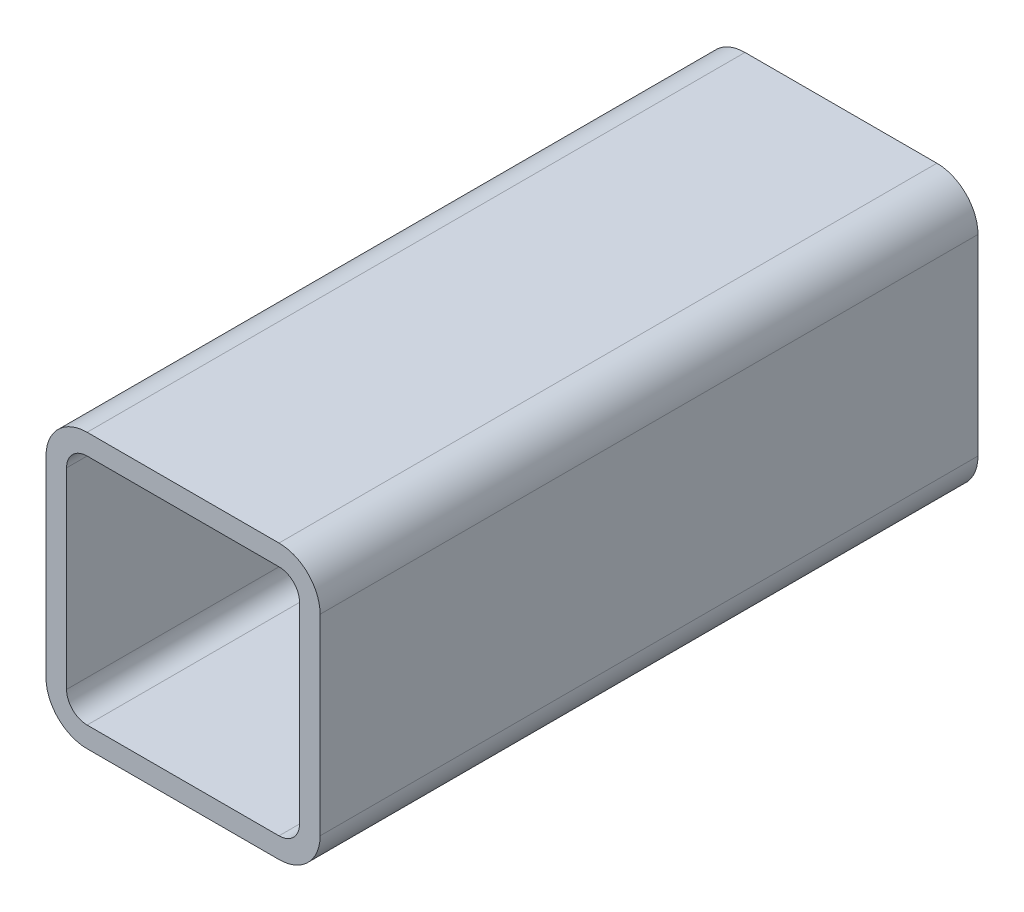
ISO-10303-21;
HEADER;
FILE_DESCRIPTION(('STEP AP214'),'2;1');
FILE_NAME('part.step','',(''),(''),'','','');
FILE_SCHEMA(('AUTOMOTIVE_DESIGN { 1 0 10303 214 1 1 1 1 }'));
ENDSEC;
DATA;
#1=APPLICATION_CONTEXT('core data for automotive mechanical design processes');
#2=APPLICATION_PROTOCOL_DEFINITION('international standard','automotive_design',2000,#1);
#3=PRODUCT_CONTEXT('',#1,'mechanical');
#4=PRODUCT('Part','Part','',(#3));
#5=PRODUCT_RELATED_PRODUCT_CATEGORY('part','',(#4));
#6=PRODUCT_DEFINITION_FORMATION('','',#4);
#7=PRODUCT_DEFINITION_CONTEXT('part definition',#1,'design');
#8=PRODUCT_DEFINITION('design','',#6,#7);
#9=PRODUCT_DEFINITION_SHAPE('','',#8);
#10=(LENGTH_UNIT() NAMED_UNIT(*) SI_UNIT(.MILLI.,.METRE.));
#11=(NAMED_UNIT(*) PLANE_ANGLE_UNIT() SI_UNIT($,.RADIAN.));
#12=(NAMED_UNIT(*) SI_UNIT($,.STERADIAN.) SOLID_ANGLE_UNIT());
#13=UNCERTAINTY_MEASURE_WITH_UNIT(LENGTH_MEASURE(1.E-05),#10,'distance_accuracy_value','');
#14=(GEOMETRIC_REPRESENTATION_CONTEXT(3) GLOBAL_UNCERTAINTY_ASSIGNED_CONTEXT((#13)) GLOBAL_UNIT_ASSIGNED_CONTEXT((#10,
#11,#12)) REPRESENTATION_CONTEXT('',''));
#15=CARTESIAN_POINT('',(0.,0.,0.));
#16=DIRECTION('',(0.,0.,1.));
#17=DIRECTION('',(1.,0.,0.));
#18=AXIS2_PLACEMENT_3D('',#15,#16,#17);
#19=CARTESIAN_POINT('',(53.975,53.975,76.2));
#20=DIRECTION('',(0.,0.,1.));
#21=DIRECTION('',(1.,0.,0.));
#22=AXIS2_PLACEMENT_3D('',#19,#20,#21);
#23=PLANE('',#22);
#24=CARTESIAN_POINT('',(53.975,53.975,76.2));
#25=DIRECTION('',(0.,0.,1.));
#26=DIRECTION('',(1.,0.,0.));
#27=AXIS2_PLACEMENT_3D('',#24,#25,#26);
#28=CIRCLE('',#27,9.525);
#29=CARTESIAN_POINT('',(63.5,53.975,76.2));
#30=VERTEX_POINT('',#29);
#31=CARTESIAN_POINT('',(53.975,63.5,76.2));
#32=VERTEX_POINT('',#31);
#33=EDGE_CURVE('E195',#30,#32,#28,.T.);
#34=ORIENTED_EDGE('',*,*,#33,.T.);
#35=DIRECTION('',(-1.,0.,0.));
#36=VECTOR('',#35,1.);
#37=CARTESIAN_POINT('',(53.975,63.5,76.2));
#38=LINE('',#37,#36);
#39=CARTESIAN_POINT('',(9.525,63.5,76.2));
#40=VERTEX_POINT('',#39);
#41=EDGE_CURVE('E198',#32,#40,#38,.T.);
#42=ORIENTED_EDGE('',*,*,#41,.T.);
#43=CARTESIAN_POINT('',(9.525,53.975,76.2));
#44=DIRECTION('',(0.,0.,1.));
#45=DIRECTION('',(1.,0.,0.));
#46=AXIS2_PLACEMENT_3D('',#43,#44,#45);
#47=CIRCLE('',#46,9.525);
#48=CARTESIAN_POINT('',(0.,53.975,76.2));
#49=VERTEX_POINT('',#48);
#50=EDGE_CURVE('E201',#40,#49,#47,.T.);
#51=ORIENTED_EDGE('',*,*,#50,.T.);
#52=DIRECTION('',(0.,-1.,0.));
#53=VECTOR('',#52,1.);
#54=CARTESIAN_POINT('',(0.,9.525,76.2));
#55=LINE('',#54,#53);
#56=CARTESIAN_POINT('',(0.,9.525,76.2));
#57=VERTEX_POINT('',#56);
#58=EDGE_CURVE('E203',#49,#57,#55,.T.);
#59=ORIENTED_EDGE('',*,*,#58,.T.);
#60=CARTESIAN_POINT('',(9.525,9.525,76.2));
#61=DIRECTION('',(0.,0.,1.));
#62=DIRECTION('',(1.,0.,0.));
#63=AXIS2_PLACEMENT_3D('',#60,#61,#62);
#64=CIRCLE('',#63,9.525);
#65=CARTESIAN_POINT('',(9.525,0.,76.2));
#66=VERTEX_POINT('',#65);
#67=EDGE_CURVE('E205',#57,#66,#64,.T.);
#68=ORIENTED_EDGE('',*,*,#67,.T.);
#69=DIRECTION('',(1.,0.,0.));
#70=VECTOR('',#69,1.);
#71=CARTESIAN_POINT('',(9.525,0.,76.2));
#72=LINE('',#71,#70);
#73=CARTESIAN_POINT('',(53.975,0.,76.2));
#74=VERTEX_POINT('',#73);
#75=EDGE_CURVE('E207',#66,#74,#72,.T.);
#76=ORIENTED_EDGE('',*,*,#75,.T.);
#77=CARTESIAN_POINT('',(53.975,9.525,76.2));
#78=DIRECTION('',(0.,0.,1.));
#79=DIRECTION('',(1.,0.,0.));
#80=AXIS2_PLACEMENT_3D('',#77,#78,#79);
#81=CIRCLE('',#80,9.525);
#82=CARTESIAN_POINT('',(63.5,9.525,76.2));
#83=VERTEX_POINT('',#82);
#84=EDGE_CURVE('E209',#74,#83,#81,.T.);
#85=ORIENTED_EDGE('',*,*,#84,.T.);
#86=DIRECTION('',(0.,1.,0.));
#87=VECTOR('',#86,1.);
#88=CARTESIAN_POINT('',(63.5,53.975,76.2));
#89=LINE('',#88,#87);
#90=EDGE_CURVE('E211',#83,#30,#89,.T.);
#91=ORIENTED_EDGE('',*,*,#90,.T.);
#92=EDGE_LOOP('',(#34,#42,#51,#59,#68,#76,#85,#91));
#93=FACE_BOUND('',#92,.T.);
#94=DIRECTION('',(0.,-1.,0.));
#95=VECTOR('',#94,1.);
#96=CARTESIAN_POINT('',(4.7625,9.525,76.2));
#97=LINE('',#96,#95);
#98=CARTESIAN_POINT('',(4.7625,53.975,76.2));
#99=VERTEX_POINT('',#98);
#100=CARTESIAN_POINT('',(4.7625,9.525,76.2));
#101=VERTEX_POINT('',#100);
#102=EDGE_CURVE('E138',#99,#101,#97,.T.);
#103=ORIENTED_EDGE('',*,*,#102,.F.);
#104=CARTESIAN_POINT('',(9.525,53.975,76.2));
#105=DIRECTION('',(0.,0.,1.));
#106=DIRECTION('',(1.,0.,0.));
#107=AXIS2_PLACEMENT_3D('',#104,#105,#106);
#108=CIRCLE('',#107,4.7625);
#109=CARTESIAN_POINT('',(9.525,58.7375,76.2));
#110=VERTEX_POINT('',#109);
#111=EDGE_CURVE('E130',#110,#99,#108,.T.);
#112=ORIENTED_EDGE('',*,*,#111,.F.);
#113=DIRECTION('',(-1.,0.,0.));
#114=VECTOR('',#113,1.);
#115=CARTESIAN_POINT('',(53.975,58.7375,76.2));
#116=LINE('',#115,#114);
#117=CARTESIAN_POINT('',(53.975,58.7375,76.2));
#118=VERTEX_POINT('',#117);
#119=EDGE_CURVE('E163',#118,#110,#116,.T.);
#120=ORIENTED_EDGE('',*,*,#119,.F.);
#121=CARTESIAN_POINT('',(53.975,53.975,76.2));
#122=DIRECTION('',(0.,0.,1.));
#123=DIRECTION('',(1.,0.,0.));
#124=AXIS2_PLACEMENT_3D('',#121,#122,#123);
#125=CIRCLE('',#124,4.7625);
#126=CARTESIAN_POINT('',(58.7375,53.975,76.2));
#127=VERTEX_POINT('',#126);
#128=EDGE_CURVE('E161',#127,#118,#125,.T.);
#129=ORIENTED_EDGE('',*,*,#128,.F.);
#130=DIRECTION('',(0.,1.,0.));
#131=VECTOR('',#130,1.);
#132=CARTESIAN_POINT('',(58.7375,53.975,76.2));
#133=LINE('',#132,#131);
#134=CARTESIAN_POINT('',(58.7375,9.525,76.2));
#135=VERTEX_POINT('',#134);
#136=EDGE_CURVE('E159',#135,#127,#133,.T.);
#137=ORIENTED_EDGE('',*,*,#136,.F.);
#138=CARTESIAN_POINT('',(53.975,9.525,76.2));
#139=DIRECTION('',(0.,0.,1.));
#140=DIRECTION('',(1.,0.,0.));
#141=AXIS2_PLACEMENT_3D('',#138,#139,#140);
#142=CIRCLE('',#141,4.7625);
#143=CARTESIAN_POINT('',(53.975,4.7625,76.2));
#144=VERTEX_POINT('',#143);
#145=EDGE_CURVE('E157',#144,#135,#142,.T.);
#146=ORIENTED_EDGE('',*,*,#145,.F.);
#147=DIRECTION('',(1.,0.,0.));
#148=VECTOR('',#147,1.);
#149=CARTESIAN_POINT('',(9.525,4.7625,76.2));
#150=LINE('',#149,#148);
#151=CARTESIAN_POINT('',(9.525,4.7625,76.2));
#152=VERTEX_POINT('',#151);
#153=EDGE_CURVE('E153',#152,#144,#150,.T.);
#154=ORIENTED_EDGE('',*,*,#153,.F.);
#155=CARTESIAN_POINT('',(9.525,9.525,76.2));
#156=DIRECTION('',(0.,0.,1.));
#157=DIRECTION('',(1.,0.,0.));
#158=AXIS2_PLACEMENT_3D('',#155,#156,#157);
#159=CIRCLE('',#158,4.7625);
#160=EDGE_CURVE('E151',#101,#152,#159,.T.);
#161=ORIENTED_EDGE('',*,*,#160,.F.);
#162=EDGE_LOOP('',(#103,#112,#120,#129,#137,#146,#154,#161));
#163=FACE_BOUND('',#162,.T.);
#164=ADVANCED_FACE('F17',(#93,#163),#23,.T.);
#165=CARTESIAN_POINT('',(53.975,53.975,-76.2));
#166=DIRECTION('',(0.,0.,1.));
#167=DIRECTION('',(1.,0.,0.));
#168=AXIS2_PLACEMENT_3D('',#165,#166,#167);
#169=PLANE('',#168);
#170=CARTESIAN_POINT('',(53.975,53.975,-76.2));
#171=DIRECTION('',(0.,0.,1.));
#172=DIRECTION('',(1.,0.,0.));
#173=AXIS2_PLACEMENT_3D('',#170,#171,#172);
#174=CIRCLE('',#173,9.525);
#175=CARTESIAN_POINT('',(63.5,53.975,-76.2));
#176=VERTEX_POINT('',#175);
#177=CARTESIAN_POINT('',(53.975,63.5,-76.2));
#178=VERTEX_POINT('',#177);
#179=EDGE_CURVE('E146',#176,#178,#174,.T.);
#180=ORIENTED_EDGE('',*,*,#179,.F.);
#181=DIRECTION('',(0.,1.,0.));
#182=VECTOR('',#181,1.);
#183=CARTESIAN_POINT('',(63.5,53.975,-76.2));
#184=LINE('',#183,#182);
#185=CARTESIAN_POINT('',(63.5,9.525,-76.2));
#186=VERTEX_POINT('',#185);
#187=EDGE_CURVE('E199',#186,#176,#184,.T.);
#188=ORIENTED_EDGE('',*,*,#187,.F.);
#189=CARTESIAN_POINT('',(53.975,9.525,-76.2));
#190=DIRECTION('',(0.,0.,1.));
#191=DIRECTION('',(1.,0.,0.));
#192=AXIS2_PLACEMENT_3D('',#189,#190,#191);
#193=CIRCLE('',#192,9.525);
#194=CARTESIAN_POINT('',(53.975,0.,-76.2));
#195=VERTEX_POINT('',#194);
#196=EDGE_CURVE('E226',#195,#186,#193,.T.);
#197=ORIENTED_EDGE('',*,*,#196,.F.);
#198=DIRECTION('',(1.,0.,0.));
#199=VECTOR('',#198,1.);
#200=CARTESIAN_POINT('',(9.525,0.,-76.2));
#201=LINE('',#200,#199);
#202=CARTESIAN_POINT('',(9.525,0.,-76.2));
#203=VERTEX_POINT('',#202);
#204=EDGE_CURVE('E224',#203,#195,#201,.T.);
#205=ORIENTED_EDGE('',*,*,#204,.F.);
#206=CARTESIAN_POINT('',(9.525,9.525,-76.2));
#207=DIRECTION('',(0.,0.,1.));
#208=DIRECTION('',(1.,0.,0.));
#209=AXIS2_PLACEMENT_3D('',#206,#207,#208);
#210=CIRCLE('',#209,9.525);
#211=CARTESIAN_POINT('',(0.,9.525,-76.2));
#212=VERTEX_POINT('',#211);
#213=EDGE_CURVE('E222',#212,#203,#210,.T.);
#214=ORIENTED_EDGE('',*,*,#213,.F.);
#215=DIRECTION('',(0.,-1.,0.));
#216=VECTOR('',#215,1.);
#217=CARTESIAN_POINT('',(0.,9.525,-76.2));
#218=LINE('',#217,#216);
#219=CARTESIAN_POINT('',(0.,53.975,-76.2));
#220=VERTEX_POINT('',#219);
#221=EDGE_CURVE('E220',#220,#212,#218,.T.);
#222=ORIENTED_EDGE('',*,*,#221,.F.);
#223=CARTESIAN_POINT('',(9.525,53.975,-76.2));
#224=DIRECTION('',(0.,0.,1.));
#225=DIRECTION('',(1.,0.,0.));
#226=AXIS2_PLACEMENT_3D('',#223,#224,#225);
#227=CIRCLE('',#226,9.525);
#228=CARTESIAN_POINT('',(9.525,63.5,-76.2));
#229=VERTEX_POINT('',#228);
#230=EDGE_CURVE('E218',#229,#220,#227,.T.);
#231=ORIENTED_EDGE('',*,*,#230,.F.);
#232=DIRECTION('',(-1.,0.,0.));
#233=VECTOR('',#232,1.);
#234=CARTESIAN_POINT('',(53.975,63.5,-76.2));
#235=LINE('',#234,#233);
#236=EDGE_CURVE('E216',#178,#229,#235,.T.);
#237=ORIENTED_EDGE('',*,*,#236,.F.);
#238=EDGE_LOOP('',(#180,#188,#197,#205,#214,#222,#231,#237));
#239=FACE_BOUND('',#238,.T.);
#240=CARTESIAN_POINT('',(9.525,53.975,-76.2));
#241=DIRECTION('',(0.,0.,1.));
#242=DIRECTION('',(1.,0.,0.));
#243=AXIS2_PLACEMENT_3D('',#240,#241,#242);
#244=CIRCLE('',#243,4.7625);
#245=CARTESIAN_POINT('',(9.525,58.7375,-76.2));
#246=VERTEX_POINT('',#245);
#247=CARTESIAN_POINT('',(4.7625,53.975,-76.2));
#248=VERTEX_POINT('',#247);
#249=EDGE_CURVE('E40',#246,#248,#244,.T.);
#250=ORIENTED_EDGE('',*,*,#249,.T.);
#251=DIRECTION('',(0.,-1.,0.));
#252=VECTOR('',#251,1.);
#253=CARTESIAN_POINT('',(4.7625,9.525,-76.2));
#254=LINE('',#253,#252);
#255=CARTESIAN_POINT('',(4.7625,9.525,-76.2));
#256=VERTEX_POINT('',#255);
#257=EDGE_CURVE('E145',#248,#256,#254,.T.);
#258=ORIENTED_EDGE('',*,*,#257,.T.);
#259=CARTESIAN_POINT('',(9.525,9.525,-76.2));
#260=DIRECTION('',(0.,0.,1.));
#261=DIRECTION('',(1.,0.,0.));
#262=AXIS2_PLACEMENT_3D('',#259,#260,#261);
#263=CIRCLE('',#262,4.7625);
#264=CARTESIAN_POINT('',(9.525,4.7625,-76.2));
#265=VERTEX_POINT('',#264);
#266=EDGE_CURVE('E167',#256,#265,#263,.T.);
#267=ORIENTED_EDGE('',*,*,#266,.T.);
#268=DIRECTION('',(1.,0.,0.));
#269=VECTOR('',#268,1.);
#270=CARTESIAN_POINT('',(9.525,4.7625,-76.2));
#271=LINE('',#270,#269);
#272=CARTESIAN_POINT('',(53.975,4.7625,-76.2));
#273=VERTEX_POINT('',#272);
#274=EDGE_CURVE('E170',#265,#273,#271,.T.);
#275=ORIENTED_EDGE('',*,*,#274,.T.);
#276=CARTESIAN_POINT('',(53.975,9.525,-76.2));
#277=DIRECTION('',(0.,0.,1.));
#278=DIRECTION('',(1.,0.,0.));
#279=AXIS2_PLACEMENT_3D('',#276,#277,#278);
#280=CIRCLE('',#279,4.7625);
#281=CARTESIAN_POINT('',(58.7375,9.525,-76.2));
#282=VERTEX_POINT('',#281);
#283=EDGE_CURVE('E173',#273,#282,#280,.T.);
#284=ORIENTED_EDGE('',*,*,#283,.T.);
#285=DIRECTION('',(0.,1.,0.));
#286=VECTOR('',#285,1.);
#287=CARTESIAN_POINT('',(58.7375,53.975,-76.2));
#288=LINE('',#287,#286);
#289=CARTESIAN_POINT('',(58.7375,53.975,-76.2));
#290=VERTEX_POINT('',#289);
#291=EDGE_CURVE('E176',#282,#290,#288,.T.);
#292=ORIENTED_EDGE('',*,*,#291,.T.);
#293=CARTESIAN_POINT('',(53.975,53.975,-76.2));
#294=DIRECTION('',(0.,0.,1.));
#295=DIRECTION('',(1.,0.,0.));
#296=AXIS2_PLACEMENT_3D('',#293,#294,#295);
#297=CIRCLE('',#296,4.7625);
#298=CARTESIAN_POINT('',(53.975,58.7375,-76.2));
#299=VERTEX_POINT('',#298);
#300=EDGE_CURVE('E179',#290,#299,#297,.T.);
#301=ORIENTED_EDGE('',*,*,#300,.T.);
#302=DIRECTION('',(-1.,0.,0.));
#303=VECTOR('',#302,1.);
#304=CARTESIAN_POINT('',(53.975,58.7375,-76.2));
#305=LINE('',#304,#303);
#306=EDGE_CURVE('E139',#299,#246,#305,.T.);
#307=ORIENTED_EDGE('',*,*,#306,.T.);
#308=EDGE_LOOP('',(#250,#258,#267,#275,#284,#292,#301,#307));
#309=FACE_BOUND('',#308,.T.);
#310=ADVANCED_FACE('F256',(#239,#309),#169,.F.);
#311=CARTESIAN_POINT('',(53.975,53.975,76.2));
#312=DIRECTION('',(0.,0.,-1.));
#313=DIRECTION('',(-1.,0.,0.));
#314=AXIS2_PLACEMENT_3D('',#311,#312,#313);
#315=CYLINDRICAL_SURFACE('',#314,9.525);
#316=ORIENTED_EDGE('',*,*,#179,.T.);
#317=DIRECTION('',(0.,0.,-1.));
#318=VECTOR('',#317,1.);
#319=CARTESIAN_POINT('',(53.975,63.5,76.2));
#320=LINE('',#319,#318);
#321=EDGE_CURVE('E11',#32,#178,#320,.T.);
#322=ORIENTED_EDGE('',*,*,#321,.F.);
#323=ORIENTED_EDGE('',*,*,#33,.F.);
#324=DIRECTION('',(0.,0.,-1.));
#325=VECTOR('',#324,1.);
#326=CARTESIAN_POINT('',(63.5,53.975,76.2));
#327=LINE('',#326,#325);
#328=EDGE_CURVE('E213',#30,#176,#327,.T.);
#329=ORIENTED_EDGE('',*,*,#328,.T.);
#330=EDGE_LOOP('',(#316,#322,#323,#329));
#331=FACE_BOUND('',#330,.T.);
#332=ADVANCED_FACE('F19',(#331),#315,.T.);
#333=CARTESIAN_POINT('',(53.975,63.5,76.2));
#334=DIRECTION('',(0.,-1.,0.));
#335=DIRECTION('',(0.,0.,-1.));
#336=AXIS2_PLACEMENT_3D('',#333,#334,#335);
#337=PLANE('',#336);
#338=ORIENTED_EDGE('',*,*,#236,.T.);
#339=DIRECTION('',(0.,0.,-1.));
#340=VECTOR('',#339,1.);
#341=CARTESIAN_POINT('',(9.525,63.5,76.2));
#342=LINE('',#341,#340);
#343=EDGE_CURVE('E25',#40,#229,#342,.T.);
#344=ORIENTED_EDGE('',*,*,#343,.F.);
#345=ORIENTED_EDGE('',*,*,#41,.F.);
#346=ORIENTED_EDGE('',*,*,#321,.T.);
#347=EDGE_LOOP('',(#338,#344,#345,#346));
#348=FACE_BOUND('',#347,.T.);
#349=ADVANCED_FACE('F273',(#348),#337,.F.);
#350=CARTESIAN_POINT('',(9.525,53.975,76.2));
#351=DIRECTION('',(0.,0.,-1.));
#352=DIRECTION('',(-1.,0.,0.));
#353=AXIS2_PLACEMENT_3D('',#350,#351,#352);
#354=CYLINDRICAL_SURFACE('',#353,9.525);
#355=ORIENTED_EDGE('',*,*,#230,.T.);
#356=DIRECTION('',(0.,0.,-1.));
#357=VECTOR('',#356,1.);
#358=CARTESIAN_POINT('',(0.,53.975,76.2));
#359=LINE('',#358,#357);
#360=EDGE_CURVE('E243',#49,#220,#359,.T.);
#361=ORIENTED_EDGE('',*,*,#360,.F.);
#362=ORIENTED_EDGE('',*,*,#50,.F.);
#363=ORIENTED_EDGE('',*,*,#343,.T.);
#364=EDGE_LOOP('',(#355,#361,#362,#363));
#365=FACE_BOUND('',#364,.T.);
#366=ADVANCED_FACE('F250',(#365),#354,.T.);
#367=CARTESIAN_POINT('',(0.,9.525,76.2));
#368=DIRECTION('',(1.,0.,0.));
#369=DIRECTION('',(0.,1.,0.));
#370=AXIS2_PLACEMENT_3D('',#367,#368,#369);
#371=PLANE('',#370);
#372=ORIENTED_EDGE('',*,*,#221,.T.);
#373=DIRECTION('',(0.,0.,-1.));
#374=VECTOR('',#373,1.);
#375=CARTESIAN_POINT('',(0.,9.525,76.2));
#376=LINE('',#375,#374);
#377=EDGE_CURVE('E240',#57,#212,#376,.T.);
#378=ORIENTED_EDGE('',*,*,#377,.F.);
#379=ORIENTED_EDGE('',*,*,#58,.F.);
#380=ORIENTED_EDGE('',*,*,#360,.T.);
#381=EDGE_LOOP('',(#372,#378,#379,#380));
#382=FACE_BOUND('',#381,.T.);
#383=ADVANCED_FACE('F262',(#382),#371,.F.);
#384=CARTESIAN_POINT('',(9.525,9.525,76.2));
#385=DIRECTION('',(0.,0.,-1.));
#386=DIRECTION('',(-1.,0.,0.));
#387=AXIS2_PLACEMENT_3D('',#384,#385,#386);
#388=CYLINDRICAL_SURFACE('',#387,9.525);
#389=ORIENTED_EDGE('',*,*,#213,.T.);
#390=DIRECTION('',(0.,0.,-1.));
#391=VECTOR('',#390,1.);
#392=CARTESIAN_POINT('',(9.525,0.,76.2));
#393=LINE('',#392,#391);
#394=EDGE_CURVE('E237',#66,#203,#393,.T.);
#395=ORIENTED_EDGE('',*,*,#394,.F.);
#396=ORIENTED_EDGE('',*,*,#67,.F.);
#397=ORIENTED_EDGE('',*,*,#377,.T.);
#398=EDGE_LOOP('',(#389,#395,#396,#397));
#399=FACE_BOUND('',#398,.T.);
#400=ADVANCED_FACE('F266',(#399),#388,.T.);
#401=CARTESIAN_POINT('',(9.525,0.,76.2));
#402=DIRECTION('',(0.,1.,0.));
#403=DIRECTION('',(-1.,0.,0.));
#404=AXIS2_PLACEMENT_3D('',#401,#402,#403);
#405=PLANE('',#404);
#406=ORIENTED_EDGE('',*,*,#204,.T.);
#407=DIRECTION('',(0.,0.,-1.));
#408=VECTOR('',#407,1.);
#409=CARTESIAN_POINT('',(53.975,0.,76.2));
#410=LINE('',#409,#408);
#411=EDGE_CURVE('E234',#74,#195,#410,.T.);
#412=ORIENTED_EDGE('',*,*,#411,.F.);
#413=ORIENTED_EDGE('',*,*,#75,.F.);
#414=ORIENTED_EDGE('',*,*,#394,.T.);
#415=EDGE_LOOP('',(#406,#412,#413,#414));
#416=FACE_BOUND('',#415,.T.);
#417=ADVANCED_FACE('F286',(#416),#405,.F.);
#418=CARTESIAN_POINT('',(53.975,9.525,76.2));
#419=DIRECTION('',(0.,0.,-1.));
#420=DIRECTION('',(-1.,0.,0.));
#421=AXIS2_PLACEMENT_3D('',#418,#419,#420);
#422=CYLINDRICAL_SURFACE('',#421,9.525);
#423=ORIENTED_EDGE('',*,*,#196,.T.);
#424=DIRECTION('',(0.,0.,-1.));
#425=VECTOR('',#424,1.);
#426=CARTESIAN_POINT('',(63.5,9.525,76.2));
#427=LINE('',#426,#425);
#428=EDGE_CURVE('E231',#83,#186,#427,.T.);
#429=ORIENTED_EDGE('',*,*,#428,.F.);
#430=ORIENTED_EDGE('',*,*,#84,.F.);
#431=ORIENTED_EDGE('',*,*,#411,.T.);
#432=EDGE_LOOP('',(#423,#429,#430,#431));
#433=FACE_BOUND('',#432,.T.);
#434=ADVANCED_FACE('F284',(#433),#422,.T.);
#435=CARTESIAN_POINT('',(63.5,53.975,76.2));
#436=DIRECTION('',(-1.,0.,0.));
#437=DIRECTION('',(0.,0.,1.));
#438=AXIS2_PLACEMENT_3D('',#435,#436,#437);
#439=PLANE('',#438);
#440=ORIENTED_EDGE('',*,*,#187,.T.);
#441=ORIENTED_EDGE('',*,*,#328,.F.);
#442=ORIENTED_EDGE('',*,*,#90,.F.);
#443=ORIENTED_EDGE('',*,*,#428,.T.);
#444=EDGE_LOOP('',(#440,#441,#442,#443));
#445=FACE_BOUND('',#444,.T.);
#446=ADVANCED_FACE('F279',(#445),#439,.F.);
#447=CARTESIAN_POINT('',(9.525,53.975,76.2));
#448=DIRECTION('',(0.,0.,-1.));
#449=DIRECTION('',(-1.,0.,0.));
#450=AXIS2_PLACEMENT_3D('',#447,#448,#449);
#451=CYLINDRICAL_SURFACE('',#450,4.7625);
#452=ORIENTED_EDGE('',*,*,#249,.F.);
#453=DIRECTION('',(0.,0.,-1.));
#454=VECTOR('',#453,1.);
#455=CARTESIAN_POINT('',(9.525,58.7375,76.2));
#456=LINE('',#455,#454);
#457=EDGE_CURVE('E134',#110,#246,#456,.T.);
#458=ORIENTED_EDGE('',*,*,#457,.F.);
#459=ORIENTED_EDGE('',*,*,#111,.T.);
#460=DIRECTION('',(0.,0.,-1.));
#461=VECTOR('',#460,1.);
#462=CARTESIAN_POINT('',(4.7625,53.975,76.2));
#463=LINE('',#462,#461);
#464=EDGE_CURVE('E133',#99,#248,#463,.T.);
#465=ORIENTED_EDGE('',*,*,#464,.T.);
#466=EDGE_LOOP('',(#452,#458,#459,#465));
#467=FACE_BOUND('',#466,.T.);
#468=ADVANCED_FACE('F132',(#467),#451,.F.);
#469=CARTESIAN_POINT('',(4.7625,9.525,76.2));
#470=DIRECTION('',(1.,0.,0.));
#471=DIRECTION('',(0.,0.,-1.));
#472=AXIS2_PLACEMENT_3D('',#469,#470,#471);
#473=PLANE('',#472);
#474=ORIENTED_EDGE('',*,*,#257,.F.);
#475=ORIENTED_EDGE('',*,*,#464,.F.);
#476=ORIENTED_EDGE('',*,*,#102,.T.);
#477=DIRECTION('',(0.,0.,-1.));
#478=VECTOR('',#477,1.);
#479=CARTESIAN_POINT('',(4.7625,9.525,76.2));
#480=LINE('',#479,#478);
#481=EDGE_CURVE('E147',#101,#256,#480,.T.);
#482=ORIENTED_EDGE('',*,*,#481,.T.);
#483=EDGE_LOOP('',(#474,#475,#476,#482));
#484=FACE_BOUND('',#483,.T.);
#485=ADVANCED_FACE('F142',(#484),#473,.T.);
#486=CARTESIAN_POINT('',(9.525,9.525,76.2));
#487=DIRECTION('',(0.,0.,-1.));
#488=DIRECTION('',(-1.,0.,0.));
#489=AXIS2_PLACEMENT_3D('',#486,#487,#488);
#490=CYLINDRICAL_SURFACE('',#489,4.7625);
#491=ORIENTED_EDGE('',*,*,#266,.F.);
#492=ORIENTED_EDGE('',*,*,#481,.F.);
#493=ORIENTED_EDGE('',*,*,#160,.T.);
#494=DIRECTION('',(0.,0.,-1.));
#495=VECTOR('',#494,1.);
#496=CARTESIAN_POINT('',(9.525,4.7625,76.2));
#497=LINE('',#496,#495);
#498=EDGE_CURVE('E192',#152,#265,#497,.T.);
#499=ORIENTED_EDGE('',*,*,#498,.T.);
#500=EDGE_LOOP('',(#491,#492,#493,#499));
#501=FACE_BOUND('',#500,.T.);
#502=ADVANCED_FACE('F316',(#501),#490,.F.);
#503=CARTESIAN_POINT('',(9.525,4.7625,76.2));
#504=DIRECTION('',(0.,1.,0.));
#505=DIRECTION('',(-1.,0.,0.));
#506=AXIS2_PLACEMENT_3D('',#503,#504,#505);
#507=PLANE('',#506);
#508=ORIENTED_EDGE('',*,*,#274,.F.);
#509=ORIENTED_EDGE('',*,*,#498,.F.);
#510=ORIENTED_EDGE('',*,*,#153,.T.);
#511=DIRECTION('',(0.,0.,-1.));
#512=VECTOR('',#511,1.);
#513=CARTESIAN_POINT('',(53.975,4.7625,76.2));
#514=LINE('',#513,#512);
#515=EDGE_CURVE('E190',#144,#273,#514,.T.);
#516=ORIENTED_EDGE('',*,*,#515,.T.);
#517=EDGE_LOOP('',(#508,#509,#510,#516));
#518=FACE_BOUND('',#517,.T.);
#519=ADVANCED_FACE('F321',(#518),#507,.T.);
#520=CARTESIAN_POINT('',(53.975,9.525,76.2));
#521=DIRECTION('',(0.,0.,-1.));
#522=DIRECTION('',(-1.,0.,0.));
#523=AXIS2_PLACEMENT_3D('',#520,#521,#522);
#524=CYLINDRICAL_SURFACE('',#523,4.7625);
#525=ORIENTED_EDGE('',*,*,#283,.F.);
#526=ORIENTED_EDGE('',*,*,#515,.F.);
#527=ORIENTED_EDGE('',*,*,#145,.T.);
#528=DIRECTION('',(0.,0.,-1.));
#529=VECTOR('',#528,1.);
#530=CARTESIAN_POINT('',(58.7375,9.525,76.2));
#531=LINE('',#530,#529);
#532=EDGE_CURVE('E188',#135,#282,#531,.T.);
#533=ORIENTED_EDGE('',*,*,#532,.T.);
#534=EDGE_LOOP('',(#525,#526,#527,#533));
#535=FACE_BOUND('',#534,.T.);
#536=ADVANCED_FACE('F327',(#535),#524,.F.);
#537=CARTESIAN_POINT('',(58.7375,53.975,76.2));
#538=DIRECTION('',(-1.,0.,0.));
#539=DIRECTION('',(0.,0.,1.));
#540=AXIS2_PLACEMENT_3D('',#537,#538,#539);
#541=PLANE('',#540);
#542=ORIENTED_EDGE('',*,*,#291,.F.);
#543=ORIENTED_EDGE('',*,*,#532,.F.);
#544=ORIENTED_EDGE('',*,*,#136,.T.);
#545=DIRECTION('',(0.,0.,-1.));
#546=VECTOR('',#545,1.);
#547=CARTESIAN_POINT('',(58.7375,53.975,76.2));
#548=LINE('',#547,#546);
#549=EDGE_CURVE('E186',#127,#290,#548,.T.);
#550=ORIENTED_EDGE('',*,*,#549,.T.);
#551=EDGE_LOOP('',(#542,#543,#544,#550));
#552=FACE_BOUND('',#551,.T.);
#553=ADVANCED_FACE('F331',(#552),#541,.T.);
#554=CARTESIAN_POINT('',(53.975,53.975,76.2));
#555=DIRECTION('',(0.,0.,-1.));
#556=DIRECTION('',(-1.,0.,0.));
#557=AXIS2_PLACEMENT_3D('',#554,#555,#556);
#558=CYLINDRICAL_SURFACE('',#557,4.7625);
#559=ORIENTED_EDGE('',*,*,#300,.F.);
#560=ORIENTED_EDGE('',*,*,#549,.F.);
#561=ORIENTED_EDGE('',*,*,#128,.T.);
#562=DIRECTION('',(0.,0.,-1.));
#563=VECTOR('',#562,1.);
#564=CARTESIAN_POINT('',(53.975,58.7375,76.2));
#565=LINE('',#564,#563);
#566=EDGE_CURVE('E32',#118,#299,#565,.T.);
#567=ORIENTED_EDGE('',*,*,#566,.T.);
#568=EDGE_LOOP('',(#559,#560,#561,#567));
#569=FACE_BOUND('',#568,.T.);
#570=ADVANCED_FACE('F335',(#569),#558,.F.);
#571=CARTESIAN_POINT('',(53.975,58.7375,76.2));
#572=DIRECTION('',(0.,-1.,0.));
#573=DIRECTION('',(1.,0.,0.));
#574=AXIS2_PLACEMENT_3D('',#571,#572,#573);
#575=PLANE('',#574);
#576=ORIENTED_EDGE('',*,*,#306,.F.);
#577=ORIENTED_EDGE('',*,*,#566,.F.);
#578=ORIENTED_EDGE('',*,*,#119,.T.);
#579=ORIENTED_EDGE('',*,*,#457,.T.);
#580=EDGE_LOOP('',(#576,#577,#578,#579));
#581=FACE_BOUND('',#580,.T.);
#582=ADVANCED_FACE('F339',(#581),#575,.T.);
#583=CLOSED_SHELL('',(#164,#310,#332,#349,#366,#383,#400,#417,#434,#446,#468,#485,#502,#519,
#536,#553,#570,#582));
#584=MANIFOLD_SOLID_BREP('B1',#583);
#585=ADVANCED_BREP_SHAPE_REPRESENTATION('',(#18,#584),#14);
#586=SHAPE_DEFINITION_REPRESENTATION(#9,#585);
ENDSEC;
END-ISO-10303-21;
